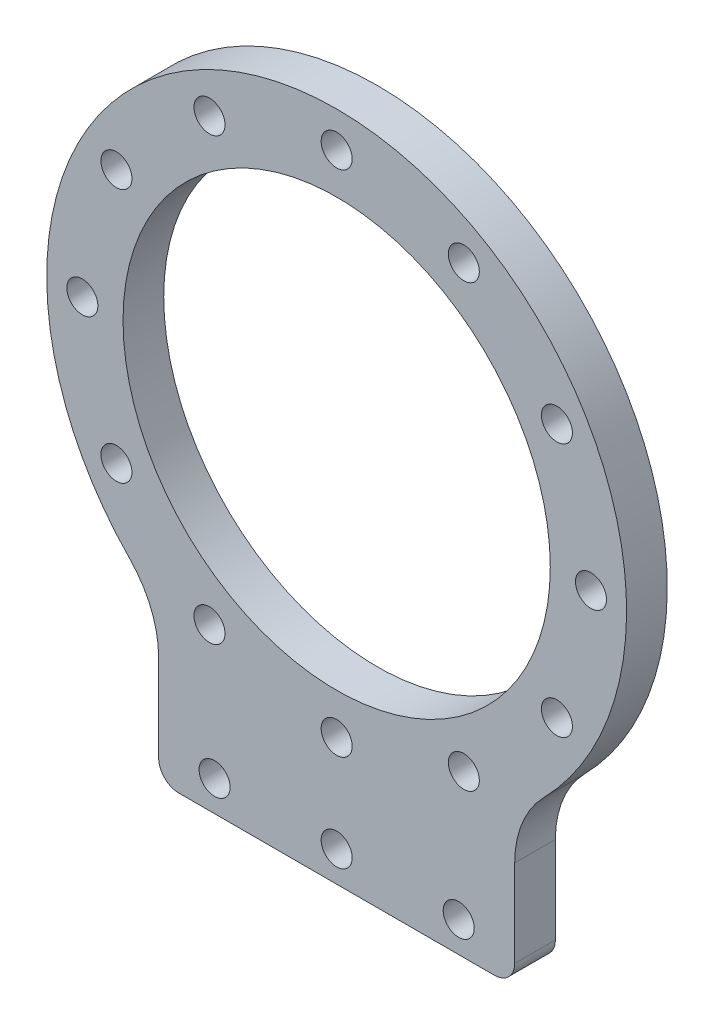
ISO-10303-21;
HEADER;
FILE_DESCRIPTION(('STEP AP214'),'2;1');
FILE_NAME('part.step','',(''),(''),'','','');
FILE_SCHEMA(('AUTOMOTIVE_DESIGN { 1 0 10303 214 1 1 1 1 }'));
ENDSEC;
DATA;
#1=APPLICATION_CONTEXT('core data for automotive mechanical design processes');
#2=APPLICATION_PROTOCOL_DEFINITION('international standard','automotive_design',2000,#1);
#3=PRODUCT_CONTEXT('',#1,'mechanical');
#4=PRODUCT('Part','Part','',(#3));
#5=PRODUCT_RELATED_PRODUCT_CATEGORY('part','',(#4));
#6=PRODUCT_DEFINITION_FORMATION('','',#4);
#7=PRODUCT_DEFINITION_CONTEXT('part definition',#1,'design');
#8=PRODUCT_DEFINITION('design','',#6,#7);
#9=PRODUCT_DEFINITION_SHAPE('','',#8);
#10=(LENGTH_UNIT() NAMED_UNIT(*) SI_UNIT(.MILLI.,.METRE.));
#11=(NAMED_UNIT(*) PLANE_ANGLE_UNIT() SI_UNIT($,.RADIAN.));
#12=(NAMED_UNIT(*) SI_UNIT($,.STERADIAN.) SOLID_ANGLE_UNIT());
#13=UNCERTAINTY_MEASURE_WITH_UNIT(LENGTH_MEASURE(1.E-05),#10,'distance_accuracy_value','');
#14=(GEOMETRIC_REPRESENTATION_CONTEXT(3) GLOBAL_UNCERTAINTY_ASSIGNED_CONTEXT((#13)) GLOBAL_UNIT_ASSIGNED_CONTEXT((#10,
#11,#12)) REPRESENTATION_CONTEXT('',''));
#15=CARTESIAN_POINT('',(0.,0.,0.));
#16=DIRECTION('',(0.,0.,1.));
#17=DIRECTION('',(1.,0.,0.));
#18=AXIS2_PLACEMENT_3D('',#15,#16,#17);
#19=CARTESIAN_POINT('',(0.,0.,4.));
#20=DIRECTION('',(0.,0.,-1.));
#21=DIRECTION('',(-1.,0.,0.));
#22=AXIS2_PLACEMENT_3D('',#19,#20,#21);
#23=CYLINDRICAL_SURFACE('',#22,28.5);
#24=CARTESIAN_POINT('',(0.,0.,4.));
#25=DIRECTION('',(0.,0.,1.));
#26=DIRECTION('',(1.,0.,0.));
#27=AXIS2_PLACEMENT_3D('',#24,#25,#26);
#28=CIRCLE('',#27,28.5);
#29=CARTESIAN_POINT('',(20.3571428571429,-19.9458450483773,4.));
#30=VERTEX_POINT('',#29);
#31=CARTESIAN_POINT('',(-20.3571428571429,-19.9458450483773,4.));
#32=VERTEX_POINT('',#31);
#33=EDGE_CURVE('E204',#30,#32,#28,.T.);
#34=ORIENTED_EDGE('',*,*,#33,.F.);
#35=DIRECTION('',(0.,0.,-1.));
#36=VECTOR('',#35,1.);
#37=CARTESIAN_POINT('',(20.3571428571429,-19.9458450483773,4.));
#38=LINE('',#37,#36);
#39=CARTESIAN_POINT('',(20.3571428571429,-19.9458450483773,0.));
#40=VERTEX_POINT('',#39);
#41=EDGE_CURVE('E172',#30,#40,#38,.T.);
#42=ORIENTED_EDGE('',*,*,#41,.T.);
#43=CARTESIAN_POINT('',(0.,0.,0.));
#44=DIRECTION('',(0.,0.,1.));
#45=DIRECTION('',(1.,0.,0.));
#46=AXIS2_PLACEMENT_3D('',#43,#44,#45);
#47=CIRCLE('',#46,28.5);
#48=CARTESIAN_POINT('',(-20.3571428571429,-19.9458450483773,0.));
#49=VERTEX_POINT('',#48);
#50=EDGE_CURVE('E189',#40,#49,#47,.T.);
#51=ORIENTED_EDGE('',*,*,#50,.T.);
#52=DIRECTION('',(0.,0.,-1.));
#53=VECTOR('',#52,1.);
#54=CARTESIAN_POINT('',(-20.3571428571429,-19.9458450483773,4.));
#55=LINE('',#54,#53);
#56=EDGE_CURVE('E169',#49,#32,#55,.F.);
#57=ORIENTED_EDGE('',*,*,#56,.T.);
#58=EDGE_LOOP('',(#34,#42,#51,#57));
#59=FACE_BOUND('',#58,.T.);
#60=ADVANCED_FACE('F45',(#59),#23,.T.);
#61=CARTESIAN_POINT('',(-17.5,0.,4.));
#62=DIRECTION('',(1.,0.,0.));
#63=DIRECTION('',(0.,1.,0.));
#64=AXIS2_PLACEMENT_3D('',#61,#62,#63);
#65=PLANE('',#64);
#66=DIRECTION('',(0.,-1.,0.));
#67=VECTOR('',#66,1.);
#68=CARTESIAN_POINT('',(-17.5,0.,4.));
#69=LINE('',#68,#67);
#70=CARTESIAN_POINT('',(-17.5,-26.944387170615,4.));
#71=VERTEX_POINT('',#70);
#72=CARTESIAN_POINT('',(-17.5,-35.5,4.));
#73=VERTEX_POINT('',#72);
#74=EDGE_CURVE('E199',#71,#73,#69,.T.);
#75=ORIENTED_EDGE('',*,*,#74,.F.);
#76=DIRECTION('',(0.,0.,1.));
#77=VECTOR('',#76,1.);
#78=CARTESIAN_POINT('',(-17.5,-26.944387170615,0.));
#79=LINE('',#78,#77);
#80=CARTESIAN_POINT('',(-17.5,-26.944387170615,0.));
#81=VERTEX_POINT('',#80);
#82=EDGE_CURVE('E179',#71,#81,#79,.F.);
#83=ORIENTED_EDGE('',*,*,#82,.T.);
#84=DIRECTION('',(0.,-1.,0.));
#85=VECTOR('',#84,1.);
#86=CARTESIAN_POINT('',(-17.5,0.,0.));
#87=LINE('',#86,#85);
#88=CARTESIAN_POINT('',(-17.5,-35.5,0.));
#89=VERTEX_POINT('',#88);
#90=EDGE_CURVE('E190',#81,#89,#87,.T.);
#91=ORIENTED_EDGE('',*,*,#90,.T.);
#92=DIRECTION('',(0.,0.,-1.));
#93=VECTOR('',#92,1.);
#94=CARTESIAN_POINT('',(-17.5,-35.5,4.));
#95=LINE('',#94,#93);
#96=EDGE_CURVE('E165',#89,#73,#95,.F.);
#97=ORIENTED_EDGE('',*,*,#96,.T.);
#98=EDGE_LOOP('',(#75,#83,#91,#97));
#99=FACE_BOUND('',#98,.T.);
#100=ADVANCED_FACE('F198',(#99),#65,.F.);
#101=CARTESIAN_POINT('',(0.,-37.5,4.));
#102=DIRECTION('',(0.,1.,0.));
#103=DIRECTION('',(0.,0.,1.));
#104=AXIS2_PLACEMENT_3D('',#101,#102,#103);
#105=PLANE('',#104);
#106=DIRECTION('',(1.,0.,0.));
#107=VECTOR('',#106,1.);
#108=CARTESIAN_POINT('',(0.,-37.5,0.));
#109=LINE('',#108,#107);
#110=CARTESIAN_POINT('',(-15.5,-37.5,0.));
#111=VERTEX_POINT('',#110);
#112=CARTESIAN_POINT('',(15.5,-37.5,0.));
#113=VERTEX_POINT('',#112);
#114=EDGE_CURVE('E123',#111,#113,#109,.T.);
#115=ORIENTED_EDGE('',*,*,#114,.T.);
#116=DIRECTION('',(0.,0.,-1.));
#117=VECTOR('',#116,1.);
#118=CARTESIAN_POINT('',(15.5,-37.5,4.));
#119=LINE('',#118,#117);
#120=CARTESIAN_POINT('',(15.5,-37.5,4.));
#121=VERTEX_POINT('',#120);
#122=EDGE_CURVE('E131',#113,#121,#119,.F.);
#123=ORIENTED_EDGE('',*,*,#122,.T.);
#124=DIRECTION('',(1.,0.,0.));
#125=VECTOR('',#124,1.);
#126=CARTESIAN_POINT('',(0.,-37.5,4.));
#127=LINE('',#126,#125);
#128=CARTESIAN_POINT('',(-15.5,-37.5,4.));
#129=VERTEX_POINT('',#128);
#130=EDGE_CURVE('E203',#129,#121,#127,.T.);
#131=ORIENTED_EDGE('',*,*,#130,.F.);
#132=DIRECTION('',(0.,0.,-1.));
#133=VECTOR('',#132,1.);
#134=CARTESIAN_POINT('',(-15.5,-37.5,4.));
#135=LINE('',#134,#133);
#136=EDGE_CURVE('E133',#129,#111,#135,.T.);
#137=ORIENTED_EDGE('',*,*,#136,.T.);
#138=EDGE_LOOP('',(#115,#123,#131,#137));
#139=FACE_BOUND('',#138,.T.);
#140=ADVANCED_FACE('F394',(#139),#105,.F.);
#141=CARTESIAN_POINT('',(25.,0.,4.));
#142=DIRECTION('',(0.,0.,-1.));
#143=DIRECTION('',(-1.,0.,0.));
#144=AXIS2_PLACEMENT_3D('',#141,#142,#143);
#145=CYLINDRICAL_SURFACE('',#144,1.525);
#146=CARTESIAN_POINT('',(25.,0.,4.));
#147=DIRECTION('',(0.,0.,1.));
#148=DIRECTION('',(1.,0.,0.));
#149=AXIS2_PLACEMENT_3D('',#146,#147,#148);
#150=CIRCLE('',#149,1.525);
#151=CARTESIAN_POINT('',(26.525,0.,4.));
#152=VERTEX_POINT('',#151);
#153=EDGE_CURVE('E148',#152,#152,#150,.T.);
#154=ORIENTED_EDGE('',*,*,#153,.T.);
#155=EDGE_LOOP('',(#154));
#156=FACE_BOUND('',#155,.T.);
#157=CARTESIAN_POINT('',(25.,0.,0.));
#158=DIRECTION('',(0.,0.,1.));
#159=DIRECTION('',(1.,0.,0.));
#160=AXIS2_PLACEMENT_3D('',#157,#158,#159);
#161=CIRCLE('',#160,1.525);
#162=CARTESIAN_POINT('',(26.525,0.,0.));
#163=VERTEX_POINT('',#162);
#164=EDGE_CURVE('E297',#163,#163,#161,.T.);
#165=ORIENTED_EDGE('',*,*,#164,.F.);
#166=EDGE_LOOP('',(#165));
#167=FACE_BOUND('',#166,.T.);
#168=ADVANCED_FACE('F489',(#156,#167),#145,.F.);
#169=CARTESIAN_POINT('',(21.6506350946108,-12.5000000000003,4.));
#170=DIRECTION('',(0.,0.,-1.));
#171=DIRECTION('',(-1.,0.,0.));
#172=AXIS2_PLACEMENT_3D('',#169,#170,#171);
#173=CYLINDRICAL_SURFACE('',#172,1.525);
#174=CARTESIAN_POINT('',(21.6506350946108,-12.5000000000003,4.));
#175=DIRECTION('',(0.,0.,1.));
#176=DIRECTION('',(1.,0.,0.));
#177=AXIS2_PLACEMENT_3D('',#174,#175,#176);
#178=CIRCLE('',#177,1.525);
#179=CARTESIAN_POINT('',(23.1756350946108,-12.5000000000003,4.));
#180=VERTEX_POINT('',#179);
#181=EDGE_CURVE('E248',#180,#180,#178,.T.);
#182=ORIENTED_EDGE('',*,*,#181,.T.);
#183=EDGE_LOOP('',(#182));
#184=FACE_BOUND('',#183,.T.);
#185=CARTESIAN_POINT('',(21.6506350946108,-12.5000000000003,0.));
#186=DIRECTION('',(0.,0.,1.));
#187=DIRECTION('',(1.,0.,0.));
#188=AXIS2_PLACEMENT_3D('',#185,#186,#187);
#189=CIRCLE('',#188,1.525);
#190=CARTESIAN_POINT('',(23.1756350946108,-12.5000000000003,0.));
#191=VERTEX_POINT('',#190);
#192=EDGE_CURVE('E294',#191,#191,#189,.T.);
#193=ORIENTED_EDGE('',*,*,#192,.F.);
#194=EDGE_LOOP('',(#193));
#195=FACE_BOUND('',#194,.T.);
#196=ADVANCED_FACE('F625',(#184,#195),#173,.F.);
#197=CARTESIAN_POINT('',(-12.5000000000004,-21.6506350946107,4.));
#198=DIRECTION('',(0.,0.,-1.));
#199=DIRECTION('',(-1.,0.,0.));
#200=AXIS2_PLACEMENT_3D('',#197,#198,#199);
#201=CYLINDRICAL_SURFACE('',#200,1.52499999999995);
#202=CARTESIAN_POINT('',(-12.5000000000004,-21.6506350946107,4.));
#203=DIRECTION('',(0.,0.,1.));
#204=DIRECTION('',(1.,0.,0.));
#205=AXIS2_PLACEMENT_3D('',#202,#203,#204);
#206=CIRCLE('',#205,1.52499999999995);
#207=CARTESIAN_POINT('',(-10.9750000000004,-21.6506350946107,4.));
#208=VERTEX_POINT('',#207);
#209=EDGE_CURVE('E244',#208,#208,#206,.T.);
#210=ORIENTED_EDGE('',*,*,#209,.T.);
#211=EDGE_LOOP('',(#210));
#212=FACE_BOUND('',#211,.T.);
#213=CARTESIAN_POINT('',(-12.5000000000004,-21.6506350946107,0.));
#214=DIRECTION('',(0.,0.,1.));
#215=DIRECTION('',(1.,0.,0.));
#216=AXIS2_PLACEMENT_3D('',#213,#214,#215);
#217=CIRCLE('',#216,1.52499999999995);
#218=CARTESIAN_POINT('',(-10.9750000000004,-21.6506350946107,0.));
#219=VERTEX_POINT('',#218);
#220=EDGE_CURVE('E290',#219,#219,#217,.T.);
#221=ORIENTED_EDGE('',*,*,#220,.F.);
#222=EDGE_LOOP('',(#221));
#223=FACE_BOUND('',#222,.T.);
#224=ADVANCED_FACE('F614',(#212,#223),#201,.F.);
#225=CARTESIAN_POINT('',(-21.650635094611,-12.4999999999999,4.));
#226=DIRECTION('',(0.,0.,-1.));
#227=DIRECTION('',(-1.,0.,0.));
#228=AXIS2_PLACEMENT_3D('',#225,#226,#227);
#229=CYLINDRICAL_SURFACE('',#228,1.525);
#230=CARTESIAN_POINT('',(-21.650635094611,-12.4999999999999,4.));
#231=DIRECTION('',(0.,0.,1.));
#232=DIRECTION('',(1.,0.,0.));
#233=AXIS2_PLACEMENT_3D('',#230,#231,#232);
#234=CIRCLE('',#233,1.525);
#235=CARTESIAN_POINT('',(-20.125635094611,-12.4999999999999,4.));
#236=VERTEX_POINT('',#235);
#237=EDGE_CURVE('E240',#236,#236,#234,.T.);
#238=ORIENTED_EDGE('',*,*,#237,.T.);
#239=EDGE_LOOP('',(#238));
#240=FACE_BOUND('',#239,.T.);
#241=CARTESIAN_POINT('',(-21.650635094611,-12.4999999999999,0.));
#242=DIRECTION('',(0.,0.,1.));
#243=DIRECTION('',(1.,0.,0.));
#244=AXIS2_PLACEMENT_3D('',#241,#242,#243);
#245=CIRCLE('',#244,1.525);
#246=CARTESIAN_POINT('',(-20.125635094611,-12.4999999999999,0.));
#247=VERTEX_POINT('',#246);
#248=EDGE_CURVE('E286',#247,#247,#245,.T.);
#249=ORIENTED_EDGE('',*,*,#248,.F.);
#250=EDGE_LOOP('',(#249));
#251=FACE_BOUND('',#250,.T.);
#252=ADVANCED_FACE('F603',(#240,#251),#229,.F.);
#253=CARTESIAN_POINT('',(-25.,1.79839122628977E-13,4.));
#254=DIRECTION('',(0.,0.,-1.));
#255=DIRECTION('',(-1.,0.,0.));
#256=AXIS2_PLACEMENT_3D('',#253,#254,#255);
#257=CYLINDRICAL_SURFACE('',#256,1.525);
#258=CARTESIAN_POINT('',(-25.,1.79839122628977E-13,4.));
#259=DIRECTION('',(0.,0.,1.));
#260=DIRECTION('',(1.,0.,0.));
#261=AXIS2_PLACEMENT_3D('',#258,#259,#260);
#262=CIRCLE('',#261,1.525);
#263=CARTESIAN_POINT('',(-23.475,1.79839122628977E-13,4.));
#264=VERTEX_POINT('',#263);
#265=EDGE_CURVE('E236',#264,#264,#262,.T.);
#266=ORIENTED_EDGE('',*,*,#265,.T.);
#267=EDGE_LOOP('',(#266));
#268=FACE_BOUND('',#267,.T.);
#269=CARTESIAN_POINT('',(-25.,1.79839122628977E-13,0.));
#270=DIRECTION('',(0.,0.,1.));
#271=DIRECTION('',(1.,0.,0.));
#272=AXIS2_PLACEMENT_3D('',#269,#270,#271);
#273=CIRCLE('',#272,1.525);
#274=CARTESIAN_POINT('',(-23.475,1.79839122628977E-13,0.));
#275=VERTEX_POINT('',#274);
#276=EDGE_CURVE('E282',#275,#275,#273,.T.);
#277=ORIENTED_EDGE('',*,*,#276,.F.);
#278=EDGE_LOOP('',(#277));
#279=FACE_BOUND('',#278,.T.);
#280=ADVANCED_FACE('F592',(#268,#279),#257,.F.);
#281=CARTESIAN_POINT('',(-21.6506350946109,12.5000000000002,4.));
#282=DIRECTION('',(0.,0.,-1.));
#283=DIRECTION('',(-1.,0.,0.));
#284=AXIS2_PLACEMENT_3D('',#281,#282,#283);
#285=CYLINDRICAL_SURFACE('',#284,1.525);
#286=CARTESIAN_POINT('',(-21.6506350946109,12.5000000000002,4.));
#287=DIRECTION('',(0.,0.,1.));
#288=DIRECTION('',(1.,0.,0.));
#289=AXIS2_PLACEMENT_3D('',#286,#287,#288);
#290=CIRCLE('',#289,1.525);
#291=CARTESIAN_POINT('',(-20.1256350946109,12.5000000000002,4.));
#292=VERTEX_POINT('',#291);
#293=EDGE_CURVE('E232',#292,#292,#290,.T.);
#294=ORIENTED_EDGE('',*,*,#293,.T.);
#295=EDGE_LOOP('',(#294));
#296=FACE_BOUND('',#295,.T.);
#297=CARTESIAN_POINT('',(-21.6506350946109,12.5000000000002,0.));
#298=DIRECTION('',(0.,0.,1.));
#299=DIRECTION('',(1.,0.,0.));
#300=AXIS2_PLACEMENT_3D('',#297,#298,#299);
#301=CIRCLE('',#300,1.525);
#302=CARTESIAN_POINT('',(-20.1256350946109,12.5000000000002,0.));
#303=VERTEX_POINT('',#302);
#304=EDGE_CURVE('E278',#303,#303,#301,.T.);
#305=ORIENTED_EDGE('',*,*,#304,.F.);
#306=EDGE_LOOP('',(#305));
#307=FACE_BOUND('',#306,.T.);
#308=ADVANCED_FACE('F581',(#296,#307),#285,.F.);
#309=CARTESIAN_POINT('',(-12.4999999999998,21.6506350946111,4.));
#310=DIRECTION('',(0.,0.,-1.));
#311=DIRECTION('',(-1.,0.,0.));
#312=AXIS2_PLACEMENT_3D('',#309,#310,#311);
#313=CYLINDRICAL_SURFACE('',#312,1.52499999999999);
#314=CARTESIAN_POINT('',(-12.4999999999998,21.6506350946111,4.));
#315=DIRECTION('',(0.,0.,1.));
#316=DIRECTION('',(1.,0.,0.));
#317=AXIS2_PLACEMENT_3D('',#314,#315,#316);
#318=CIRCLE('',#317,1.52499999999999);
#319=CARTESIAN_POINT('',(-10.9749999999998,21.6506350946111,4.));
#320=VERTEX_POINT('',#319);
#321=EDGE_CURVE('E228',#320,#320,#318,.T.);
#322=ORIENTED_EDGE('',*,*,#321,.T.);
#323=EDGE_LOOP('',(#322));
#324=FACE_BOUND('',#323,.T.);
#325=CARTESIAN_POINT('',(-12.4999999999998,21.6506350946111,0.));
#326=DIRECTION('',(0.,0.,1.));
#327=DIRECTION('',(1.,0.,0.));
#328=AXIS2_PLACEMENT_3D('',#325,#326,#327);
#329=CIRCLE('',#328,1.52499999999999);
#330=CARTESIAN_POINT('',(-10.9749999999998,21.6506350946111,0.));
#331=VERTEX_POINT('',#330);
#332=EDGE_CURVE('E274',#331,#331,#329,.T.);
#333=ORIENTED_EDGE('',*,*,#332,.F.);
#334=EDGE_LOOP('',(#333));
#335=FACE_BOUND('',#334,.T.);
#336=ADVANCED_FACE('F570',(#324,#335),#313,.F.);
#337=CARTESIAN_POINT('',(2.63677968348475E-13,25.,4.));
#338=DIRECTION('',(0.,0.,-1.));
#339=DIRECTION('',(-1.,0.,0.));
#340=AXIS2_PLACEMENT_3D('',#337,#338,#339);
#341=CYLINDRICAL_SURFACE('',#340,1.52499999999999);
#342=CARTESIAN_POINT('',(2.63677968348475E-13,25.,4.));
#343=DIRECTION('',(0.,0.,1.));
#344=DIRECTION('',(1.,0.,0.));
#345=AXIS2_PLACEMENT_3D('',#342,#343,#344);
#346=CIRCLE('',#345,1.52499999999999);
#347=CARTESIAN_POINT('',(1.52500000000026,25.,4.));
#348=VERTEX_POINT('',#347);
#349=EDGE_CURVE('E224',#348,#348,#346,.T.);
#350=ORIENTED_EDGE('',*,*,#349,.T.);
#351=EDGE_LOOP('',(#350));
#352=FACE_BOUND('',#351,.T.);
#353=CARTESIAN_POINT('',(2.63677968348475E-13,25.,0.));
#354=DIRECTION('',(0.,0.,1.));
#355=DIRECTION('',(1.,0.,0.));
#356=AXIS2_PLACEMENT_3D('',#353,#354,#355);
#357=CIRCLE('',#356,1.52499999999999);
#358=CARTESIAN_POINT('',(1.52500000000026,25.,0.));
#359=VERTEX_POINT('',#358);
#360=EDGE_CURVE('E270',#359,#359,#357,.T.);
#361=ORIENTED_EDGE('',*,*,#360,.F.);
#362=EDGE_LOOP('',(#361));
#363=FACE_BOUND('',#362,.T.);
#364=ADVANCED_FACE('F559',(#352,#363),#341,.F.);
#365=CARTESIAN_POINT('',(12.5000000000003,21.6506350946108,4.));
#366=DIRECTION('',(0.,0.,-1.));
#367=DIRECTION('',(-1.,0.,0.));
#368=AXIS2_PLACEMENT_3D('',#365,#366,#367);
#369=CYLINDRICAL_SURFACE('',#368,1.525);
#370=CARTESIAN_POINT('',(12.5000000000003,21.6506350946108,4.));
#371=DIRECTION('',(0.,0.,1.));
#372=DIRECTION('',(1.,0.,0.));
#373=AXIS2_PLACEMENT_3D('',#370,#371,#372);
#374=CIRCLE('',#373,1.525);
#375=CARTESIAN_POINT('',(14.0250000000003,21.6506350946108,4.));
#376=VERTEX_POINT('',#375);
#377=EDGE_CURVE('E220',#376,#376,#374,.T.);
#378=ORIENTED_EDGE('',*,*,#377,.T.);
#379=EDGE_LOOP('',(#378));
#380=FACE_BOUND('',#379,.T.);
#381=CARTESIAN_POINT('',(12.5000000000003,21.6506350946108,0.));
#382=DIRECTION('',(0.,0.,1.));
#383=DIRECTION('',(1.,0.,0.));
#384=AXIS2_PLACEMENT_3D('',#381,#382,#383);
#385=CIRCLE('',#384,1.525);
#386=CARTESIAN_POINT('',(14.0250000000003,21.6506350946108,0.));
#387=VERTEX_POINT('',#386);
#388=EDGE_CURVE('E266',#387,#387,#385,.T.);
#389=ORIENTED_EDGE('',*,*,#388,.F.);
#390=EDGE_LOOP('',(#389));
#391=FACE_BOUND('',#390,.T.);
#392=ADVANCED_FACE('F548',(#380,#391),#369,.F.);
#393=CARTESIAN_POINT('',(21.6506350946111,12.4999999999997,4.));
#394=DIRECTION('',(0.,0.,-1.));
#395=DIRECTION('',(-1.,0.,0.));
#396=AXIS2_PLACEMENT_3D('',#393,#394,#395);
#397=CYLINDRICAL_SURFACE('',#396,1.525);
#398=CARTESIAN_POINT('',(21.6506350946111,12.4999999999997,4.));
#399=DIRECTION('',(0.,0.,1.));
#400=DIRECTION('',(1.,0.,0.));
#401=AXIS2_PLACEMENT_3D('',#398,#399,#400);
#402=CIRCLE('',#401,1.525);
#403=CARTESIAN_POINT('',(23.1756350946111,12.4999999999997,4.));
#404=VERTEX_POINT('',#403);
#405=EDGE_CURVE('E216',#404,#404,#402,.T.);
#406=ORIENTED_EDGE('',*,*,#405,.T.);
#407=EDGE_LOOP('',(#406));
#408=FACE_BOUND('',#407,.T.);
#409=CARTESIAN_POINT('',(21.6506350946111,12.4999999999997,0.));
#410=DIRECTION('',(0.,0.,1.));
#411=DIRECTION('',(1.,0.,0.));
#412=AXIS2_PLACEMENT_3D('',#409,#410,#411);
#413=CIRCLE('',#412,1.525);
#414=CARTESIAN_POINT('',(23.1756350946111,12.4999999999997,0.));
#415=VERTEX_POINT('',#414);
#416=EDGE_CURVE('E122',#415,#415,#413,.T.);
#417=ORIENTED_EDGE('',*,*,#416,.F.);
#418=EDGE_LOOP('',(#417));
#419=FACE_BOUND('',#418,.T.);
#420=ADVANCED_FACE('F449',(#408,#419),#397,.F.);
#421=CARTESIAN_POINT('',(17.5,0.,4.));
#422=DIRECTION('',(1.,0.,0.));
#423=DIRECTION('',(0.,1.,0.));
#424=AXIS2_PLACEMENT_3D('',#421,#422,#423);
#425=PLANE('',#424);
#426=DIRECTION('',(0.,-1.,0.));
#427=VECTOR('',#426,1.);
#428=CARTESIAN_POINT('',(17.5,0.,0.));
#429=LINE('',#428,#427);
#430=CARTESIAN_POINT('',(17.5,-26.944387170615,0.));
#431=VERTEX_POINT('',#430);
#432=CARTESIAN_POINT('',(17.5,-35.5,0.));
#433=VERTEX_POINT('',#432);
#434=EDGE_CURVE('E109',#431,#433,#429,.T.);
#435=ORIENTED_EDGE('',*,*,#434,.F.);
#436=DIRECTION('',(0.,0.,-1.));
#437=VECTOR('',#436,1.);
#438=CARTESIAN_POINT('',(17.5,-26.944387170615,4.));
#439=LINE('',#438,#437);
#440=CARTESIAN_POINT('',(17.5,-26.944387170615,4.));
#441=VERTEX_POINT('',#440);
#442=EDGE_CURVE('E176',#431,#441,#439,.F.);
#443=ORIENTED_EDGE('',*,*,#442,.T.);
#444=DIRECTION('',(0.,-1.,0.));
#445=VECTOR('',#444,1.);
#446=CARTESIAN_POINT('',(17.5,0.,4.));
#447=LINE('',#446,#445);
#448=CARTESIAN_POINT('',(17.5,-35.5,4.));
#449=VERTEX_POINT('',#448);
#450=EDGE_CURVE('E138',#441,#449,#447,.T.);
#451=ORIENTED_EDGE('',*,*,#450,.T.);
#452=DIRECTION('',(0.,0.,-1.));
#453=VECTOR('',#452,1.);
#454=CARTESIAN_POINT('',(17.5,-35.5,0.));
#455=LINE('',#454,#453);
#456=EDGE_CURVE('E130',#449,#433,#455,.T.);
#457=ORIENTED_EDGE('',*,*,#456,.T.);
#458=EDGE_LOOP('',(#435,#443,#451,#457));
#459=FACE_BOUND('',#458,.T.);
#460=ADVANCED_FACE('F136',(#459),#425,.T.);
#461=CARTESIAN_POINT('',(12.4999999999996,-21.6506350946112,4.));
#462=DIRECTION('',(0.,0.,-1.));
#463=DIRECTION('',(-1.,0.,0.));
#464=AXIS2_PLACEMENT_3D('',#461,#462,#463);
#465=CYLINDRICAL_SURFACE('',#464,1.525);
#466=CARTESIAN_POINT('',(12.4999999999996,-21.6506350946112,4.));
#467=DIRECTION('',(0.,0.,1.));
#468=DIRECTION('',(1.,0.,0.));
#469=AXIS2_PLACEMENT_3D('',#466,#467,#468);
#470=CIRCLE('',#469,1.525);
#471=CARTESIAN_POINT('',(14.0249999999996,-21.6506350946112,4.));
#472=VERTEX_POINT('',#471);
#473=EDGE_CURVE('E210',#472,#472,#470,.T.);
#474=ORIENTED_EDGE('',*,*,#473,.T.);
#475=EDGE_LOOP('',(#474));
#476=FACE_BOUND('',#475,.T.);
#477=CARTESIAN_POINT('',(12.4999999999996,-21.6506350946112,0.));
#478=DIRECTION('',(0.,0.,1.));
#479=DIRECTION('',(1.,0.,0.));
#480=AXIS2_PLACEMENT_3D('',#477,#478,#479);
#481=CIRCLE('',#480,1.525);
#482=CARTESIAN_POINT('',(14.0249999999996,-21.6506350946112,0.));
#483=VERTEX_POINT('',#482);
#484=EDGE_CURVE('E195',#483,#483,#481,.T.);
#485=ORIENTED_EDGE('',*,*,#484,.F.);
#486=EDGE_LOOP('',(#485));
#487=FACE_BOUND('',#486,.T.);
#488=ADVANCED_FACE('F381',(#476,#487),#465,.F.);
#489=CARTESIAN_POINT('',(-4.38885039422132E-13,-25.,4.));
#490=DIRECTION('',(0.,0.,-1.));
#491=DIRECTION('',(-1.,0.,0.));
#492=AXIS2_PLACEMENT_3D('',#489,#490,#491);
#493=CYLINDRICAL_SURFACE('',#492,1.525);
#494=CARTESIAN_POINT('',(-4.38885039422132E-13,-25.,4.));
#495=DIRECTION('',(0.,0.,1.));
#496=DIRECTION('',(1.,0.,0.));
#497=AXIS2_PLACEMENT_3D('',#494,#495,#496);
#498=CIRCLE('',#497,1.525);
#499=CARTESIAN_POINT('',(1.52499999999956,-25.,4.));
#500=VERTEX_POINT('',#499);
#501=EDGE_CURVE('E141',#500,#500,#498,.T.);
#502=ORIENTED_EDGE('',*,*,#501,.T.);
#503=EDGE_LOOP('',(#502));
#504=FACE_BOUND('',#503,.T.);
#505=CARTESIAN_POINT('',(-4.38885039422132E-13,-25.,0.));
#506=DIRECTION('',(0.,0.,1.));
#507=DIRECTION('',(1.,0.,0.));
#508=AXIS2_PLACEMENT_3D('',#505,#506,#507);
#509=CIRCLE('',#508,1.525);
#510=CARTESIAN_POINT('',(1.52499999999956,-25.,0.));
#511=VERTEX_POINT('',#510);
#512=EDGE_CURVE('E151',#511,#511,#509,.T.);
#513=ORIENTED_EDGE('',*,*,#512,.F.);
#514=EDGE_LOOP('',(#513));
#515=FACE_BOUND('',#514,.T.);
#516=ADVANCED_FACE('F348',(#504,#515),#493,.F.);
#517=CARTESIAN_POINT('',(0.,0.,4.));
#518=DIRECTION('',(0.,0.,1.));
#519=DIRECTION('',(1.,0.,0.));
#520=AXIS2_PLACEMENT_3D('',#517,#518,#519);
#521=PLANE('',#520);
#522=CARTESIAN_POINT('',(-12.,-34.5,4.));
#523=DIRECTION('',(0.,0.,1.));
#524=DIRECTION('',(-1.,0.,0.));
#525=AXIS2_PLACEMENT_3D('',#522,#523,#524);
#526=CIRCLE('',#525,1.525);
#527=CARTESIAN_POINT('',(-13.525,-34.5,4.));
#528=VERTEX_POINT('',#527);
#529=EDGE_CURVE('E331',#528,#528,#526,.T.);
#530=ORIENTED_EDGE('',*,*,#529,.F.);
#531=EDGE_LOOP('',(#530));
#532=FACE_BOUND('',#531,.T.);
#533=CARTESIAN_POINT('',(12.,-34.5,4.));
#534=DIRECTION('',(0.,0.,1.));
#535=DIRECTION('',(1.,0.,0.));
#536=AXIS2_PLACEMENT_3D('',#533,#534,#535);
#537=CIRCLE('',#536,1.525);
#538=CARTESIAN_POINT('',(13.525,-34.5,4.));
#539=VERTEX_POINT('',#538);
#540=EDGE_CURVE('E323',#539,#539,#537,.T.);
#541=ORIENTED_EDGE('',*,*,#540,.F.);
#542=EDGE_LOOP('',(#541));
#543=FACE_BOUND('',#542,.T.);
#544=CARTESIAN_POINT('',(0.,-34.5,4.));
#545=DIRECTION('',(0.,0.,1.));
#546=DIRECTION('',(1.,0.,0.));
#547=AXIS2_PLACEMENT_3D('',#544,#545,#546);
#548=CIRCLE('',#547,1.525);
#549=CARTESIAN_POINT('',(1.525,-34.5,4.));
#550=VERTEX_POINT('',#549);
#551=EDGE_CURVE('E319',#550,#550,#548,.T.);
#552=ORIENTED_EDGE('',*,*,#551,.F.);
#553=EDGE_LOOP('',(#552));
#554=FACE_BOUND('',#553,.T.);
#555=CARTESIAN_POINT('',(0.,0.,4.));
#556=DIRECTION('',(0.,0.,1.));
#557=DIRECTION('',(1.,0.,0.));
#558=AXIS2_PLACEMENT_3D('',#555,#556,#557);
#559=CIRCLE('',#558,21.);
#560=CARTESIAN_POINT('',(21.,0.,4.));
#561=VERTEX_POINT('',#560);
#562=EDGE_CURVE('E311',#561,#561,#559,.T.);
#563=ORIENTED_EDGE('',*,*,#562,.F.);
#564=EDGE_LOOP('',(#563));
#565=FACE_BOUND('',#564,.T.);
#566=ORIENTED_EDGE('',*,*,#473,.F.);
#567=EDGE_LOOP('',(#566));
#568=FACE_BOUND('',#567,.T.);
#569=ORIENTED_EDGE('',*,*,#130,.T.);
#570=CARTESIAN_POINT('',(15.5,-35.5,4.));
#571=DIRECTION('',(0.,0.,1.));
#572=DIRECTION('',(1.,0.,0.));
#573=AXIS2_PLACEMENT_3D('',#570,#571,#572);
#574=CIRCLE('',#573,2.);
#575=EDGE_CURVE('E162',#121,#449,#574,.T.);
#576=ORIENTED_EDGE('',*,*,#575,.T.);
#577=ORIENTED_EDGE('',*,*,#450,.F.);
#578=CARTESIAN_POINT('',(27.5,-26.944387170615,4.));
#579=DIRECTION('',(0.,0.,1.));
#580=DIRECTION('',(1.,0.,0.));
#581=AXIS2_PLACEMENT_3D('',#578,#579,#580);
#582=CIRCLE('',#581,10.);
#583=EDGE_CURVE('E184',#441,#30,#582,.F.);
#584=ORIENTED_EDGE('',*,*,#583,.T.);
#585=ORIENTED_EDGE('',*,*,#33,.T.);
#586=CARTESIAN_POINT('',(-27.5,-26.944387170615,4.));
#587=DIRECTION('',(0.,0.,1.));
#588=DIRECTION('',(1.,0.,0.));
#589=AXIS2_PLACEMENT_3D('',#586,#587,#588);
#590=CIRCLE('',#589,10.);
#591=EDGE_CURVE('E11',#32,#71,#590,.F.);
#592=ORIENTED_EDGE('',*,*,#591,.T.);
#593=ORIENTED_EDGE('',*,*,#74,.T.);
#594=CARTESIAN_POINT('',(-15.5,-35.5,4.));
#595=DIRECTION('',(0.,0.,1.));
#596=DIRECTION('',(1.,0.,0.));
#597=AXIS2_PLACEMENT_3D('',#594,#595,#596);
#598=CIRCLE('',#597,2.);
#599=EDGE_CURVE('E159',#73,#129,#598,.T.);
#600=ORIENTED_EDGE('',*,*,#599,.T.);
#601=EDGE_LOOP('',(#569,#576,#577,#584,#585,#592,#593,#600));
#602=FACE_BOUND('',#601,.T.);
#603=ORIENTED_EDGE('',*,*,#405,.F.);
#604=EDGE_LOOP('',(#603));
#605=FACE_BOUND('',#604,.T.);
#606=ORIENTED_EDGE('',*,*,#377,.F.);
#607=EDGE_LOOP('',(#606));
#608=FACE_BOUND('',#607,.T.);
#609=ORIENTED_EDGE('',*,*,#349,.F.);
#610=EDGE_LOOP('',(#609));
#611=FACE_BOUND('',#610,.T.);
#612=ORIENTED_EDGE('',*,*,#321,.F.);
#613=EDGE_LOOP('',(#612));
#614=FACE_BOUND('',#613,.T.);
#615=ORIENTED_EDGE('',*,*,#293,.F.);
#616=EDGE_LOOP('',(#615));
#617=FACE_BOUND('',#616,.T.);
#618=ORIENTED_EDGE('',*,*,#265,.F.);
#619=EDGE_LOOP('',(#618));
#620=FACE_BOUND('',#619,.T.);
#621=ORIENTED_EDGE('',*,*,#237,.F.);
#622=EDGE_LOOP('',(#621));
#623=FACE_BOUND('',#622,.T.);
#624=ORIENTED_EDGE('',*,*,#209,.F.);
#625=EDGE_LOOP('',(#624));
#626=FACE_BOUND('',#625,.T.);
#627=ORIENTED_EDGE('',*,*,#181,.F.);
#628=EDGE_LOOP('',(#627));
#629=FACE_BOUND('',#628,.T.);
#630=ORIENTED_EDGE('',*,*,#153,.F.);
#631=EDGE_LOOP('',(#630));
#632=FACE_BOUND('',#631,.T.);
#633=ORIENTED_EDGE('',*,*,#501,.F.);
#634=EDGE_LOOP('',(#633));
#635=FACE_BOUND('',#634,.T.);
#636=ADVANCED_FACE('F345',(#532,#543,#554,#565,#568,#602,#605,#608,#611,#614,#617,#620,#623,
#626,#629,#632,#635),#521,.T.);
#637=CARTESIAN_POINT('',(0.,0.,0.));
#638=DIRECTION('',(0.,0.,1.));
#639=DIRECTION('',(1.,0.,0.));
#640=AXIS2_PLACEMENT_3D('',#637,#638,#639);
#641=PLANE('',#640);
#642=CARTESIAN_POINT('',(-12.,-34.5,0.));
#643=DIRECTION('',(0.,0.,1.));
#644=DIRECTION('',(-1.,0.,0.));
#645=AXIS2_PLACEMENT_3D('',#642,#643,#644);
#646=CIRCLE('',#645,1.525);
#647=CARTESIAN_POINT('',(-13.525,-34.5,0.));
#648=VERTEX_POINT('',#647);
#649=EDGE_CURVE('E327',#648,#648,#646,.T.);
#650=ORIENTED_EDGE('',*,*,#649,.T.);
#651=EDGE_LOOP('',(#650));
#652=FACE_BOUND('',#651,.T.);
#653=CARTESIAN_POINT('',(12.,-34.5,0.));
#654=DIRECTION('',(0.,0.,1.));
#655=DIRECTION('',(1.,0.,0.));
#656=AXIS2_PLACEMENT_3D('',#653,#654,#655);
#657=CIRCLE('',#656,1.525);
#658=CARTESIAN_POINT('',(13.525,-34.5,0.));
#659=VERTEX_POINT('',#658);
#660=EDGE_CURVE('E335',#659,#659,#657,.T.);
#661=ORIENTED_EDGE('',*,*,#660,.T.);
#662=EDGE_LOOP('',(#661));
#663=FACE_BOUND('',#662,.T.);
#664=CARTESIAN_POINT('',(0.,-34.5,0.));
#665=DIRECTION('',(0.,0.,1.));
#666=DIRECTION('',(1.,0.,0.));
#667=AXIS2_PLACEMENT_3D('',#664,#665,#666);
#668=CIRCLE('',#667,1.525);
#669=CARTESIAN_POINT('',(1.525,-34.5,0.));
#670=VERTEX_POINT('',#669);
#671=EDGE_CURVE('E315',#670,#670,#668,.T.);
#672=ORIENTED_EDGE('',*,*,#671,.T.);
#673=EDGE_LOOP('',(#672));
#674=FACE_BOUND('',#673,.T.);
#675=CARTESIAN_POINT('',(0.,0.,0.));
#676=DIRECTION('',(0.,0.,1.));
#677=DIRECTION('',(1.,0.,0.));
#678=AXIS2_PLACEMENT_3D('',#675,#676,#677);
#679=CIRCLE('',#678,21.);
#680=CARTESIAN_POINT('',(21.,0.,0.));
#681=VERTEX_POINT('',#680);
#682=EDGE_CURVE('E257',#681,#681,#679,.T.);
#683=ORIENTED_EDGE('',*,*,#682,.T.);
#684=EDGE_LOOP('',(#683));
#685=FACE_BOUND('',#684,.T.);
#686=ORIENTED_EDGE('',*,*,#484,.T.);
#687=EDGE_LOOP('',(#686));
#688=FACE_BOUND('',#687,.T.);
#689=ORIENTED_EDGE('',*,*,#50,.F.);
#690=CARTESIAN_POINT('',(27.5,-26.944387170615,0.));
#691=DIRECTION('',(0.,0.,1.));
#692=DIRECTION('',(1.,0.,0.));
#693=AXIS2_PLACEMENT_3D('',#690,#691,#692);
#694=CIRCLE('',#693,10.);
#695=EDGE_CURVE('E117',#40,#431,#694,.T.);
#696=ORIENTED_EDGE('',*,*,#695,.T.);
#697=ORIENTED_EDGE('',*,*,#434,.T.);
#698=CARTESIAN_POINT('',(15.5,-35.5,0.));
#699=DIRECTION('',(0.,0.,1.));
#700=DIRECTION('',(1.,0.,0.));
#701=AXIS2_PLACEMENT_3D('',#698,#699,#700);
#702=CIRCLE('',#701,2.);
#703=EDGE_CURVE('E115',#433,#113,#702,.F.);
#704=ORIENTED_EDGE('',*,*,#703,.T.);
#705=ORIENTED_EDGE('',*,*,#114,.F.);
#706=CARTESIAN_POINT('',(-15.5,-35.5,0.));
#707=DIRECTION('',(0.,0.,1.));
#708=DIRECTION('',(1.,0.,0.));
#709=AXIS2_PLACEMENT_3D('',#706,#707,#708);
#710=CIRCLE('',#709,2.);
#711=EDGE_CURVE('E134',#111,#89,#710,.F.);
#712=ORIENTED_EDGE('',*,*,#711,.T.);
#713=ORIENTED_EDGE('',*,*,#90,.F.);
#714=CARTESIAN_POINT('',(-27.5,-26.944387170615,0.));
#715=DIRECTION('',(0.,0.,1.));
#716=DIRECTION('',(1.,0.,0.));
#717=AXIS2_PLACEMENT_3D('',#714,#715,#716);
#718=CIRCLE('',#717,10.);
#719=EDGE_CURVE('E54',#81,#49,#718,.T.);
#720=ORIENTED_EDGE('',*,*,#719,.T.);
#721=EDGE_LOOP('',(#689,#696,#697,#704,#705,#712,#713,#720));
#722=FACE_BOUND('',#721,.T.);
#723=ORIENTED_EDGE('',*,*,#416,.T.);
#724=EDGE_LOOP('',(#723));
#725=FACE_BOUND('',#724,.T.);
#726=ORIENTED_EDGE('',*,*,#388,.T.);
#727=EDGE_LOOP('',(#726));
#728=FACE_BOUND('',#727,.T.);
#729=ORIENTED_EDGE('',*,*,#360,.T.);
#730=EDGE_LOOP('',(#729));
#731=FACE_BOUND('',#730,.T.);
#732=ORIENTED_EDGE('',*,*,#332,.T.);
#733=EDGE_LOOP('',(#732));
#734=FACE_BOUND('',#733,.T.);
#735=ORIENTED_EDGE('',*,*,#304,.T.);
#736=EDGE_LOOP('',(#735));
#737=FACE_BOUND('',#736,.T.);
#738=ORIENTED_EDGE('',*,*,#276,.T.);
#739=EDGE_LOOP('',(#738));
#740=FACE_BOUND('',#739,.T.);
#741=ORIENTED_EDGE('',*,*,#248,.T.);
#742=EDGE_LOOP('',(#741));
#743=FACE_BOUND('',#742,.T.);
#744=ORIENTED_EDGE('',*,*,#220,.T.);
#745=EDGE_LOOP('',(#744));
#746=FACE_BOUND('',#745,.T.);
#747=ORIENTED_EDGE('',*,*,#192,.T.);
#748=EDGE_LOOP('',(#747));
#749=FACE_BOUND('',#748,.T.);
#750=ORIENTED_EDGE('',*,*,#164,.T.);
#751=EDGE_LOOP('',(#750));
#752=FACE_BOUND('',#751,.T.);
#753=ORIENTED_EDGE('',*,*,#512,.T.);
#754=EDGE_LOOP('',(#753));
#755=FACE_BOUND('',#754,.T.);
#756=ADVANCED_FACE('F112',(#652,#663,#674,#685,#688,#722,#725,#728,#731,#734,#737,#740,#743,
#746,#749,#752,#755),#641,.F.);
#757=CARTESIAN_POINT('',(0.,0.,0.));
#758=DIRECTION('',(0.,0.,1.));
#759=DIRECTION('',(1.,0.,0.));
#760=AXIS2_PLACEMENT_3D('',#757,#758,#759);
#761=CYLINDRICAL_SURFACE('',#760,21.);
#762=ORIENTED_EDGE('',*,*,#682,.F.);
#763=EDGE_LOOP('',(#762));
#764=FACE_BOUND('',#763,.T.);
#765=ORIENTED_EDGE('',*,*,#562,.T.);
#766=EDGE_LOOP('',(#765));
#767=FACE_BOUND('',#766,.T.);
#768=ADVANCED_FACE('F429',(#764,#767),#761,.F.);
#769=CARTESIAN_POINT('',(0.,-34.5,0.));
#770=DIRECTION('',(0.,0.,1.));
#771=DIRECTION('',(1.,0.,0.));
#772=AXIS2_PLACEMENT_3D('',#769,#770,#771);
#773=CYLINDRICAL_SURFACE('',#772,1.525);
#774=ORIENTED_EDGE('',*,*,#671,.F.);
#775=EDGE_LOOP('',(#774));
#776=FACE_BOUND('',#775,.T.);
#777=ORIENTED_EDGE('',*,*,#551,.T.);
#778=EDGE_LOOP('',(#777));
#779=FACE_BOUND('',#778,.T.);
#780=ADVANCED_FACE('F509',(#776,#779),#773,.F.);
#781=CARTESIAN_POINT('',(12.,-34.5,0.));
#782=DIRECTION('',(0.,0.,1.));
#783=DIRECTION('',(1.,0.,0.));
#784=AXIS2_PLACEMENT_3D('',#781,#782,#783);
#785=CYLINDRICAL_SURFACE('',#784,1.525);
#786=ORIENTED_EDGE('',*,*,#660,.F.);
#787=EDGE_LOOP('',(#786));
#788=FACE_BOUND('',#787,.T.);
#789=ORIENTED_EDGE('',*,*,#540,.T.);
#790=EDGE_LOOP('',(#789));
#791=FACE_BOUND('',#790,.T.);
#792=ADVANCED_FACE('F343',(#788,#791),#785,.F.);
#793=CARTESIAN_POINT('',(-12.,-34.5,0.));
#794=DIRECTION('',(0.,0.,1.));
#795=DIRECTION('',(1.,0.,0.));
#796=AXIS2_PLACEMENT_3D('',#793,#794,#795);
#797=CYLINDRICAL_SURFACE('',#796,1.525);
#798=ORIENTED_EDGE('',*,*,#649,.F.);
#799=EDGE_LOOP('',(#798));
#800=FACE_BOUND('',#799,.T.);
#801=ORIENTED_EDGE('',*,*,#529,.T.);
#802=EDGE_LOOP('',(#801));
#803=FACE_BOUND('',#802,.T.);
#804=ADVANCED_FACE('F401',(#800,#803),#797,.F.);
#805=CARTESIAN_POINT('',(15.5,-35.5,4.));
#806=DIRECTION('',(0.,0.,1.));
#807=DIRECTION('',(1.,0.,0.));
#808=AXIS2_PLACEMENT_3D('',#805,#806,#807);
#809=CYLINDRICAL_SURFACE('',#808,2.);
#810=ORIENTED_EDGE('',*,*,#575,.F.);
#811=ORIENTED_EDGE('',*,*,#122,.F.);
#812=ORIENTED_EDGE('',*,*,#703,.F.);
#813=ORIENTED_EDGE('',*,*,#456,.F.);
#814=EDGE_LOOP('',(#810,#811,#812,#813));
#815=FACE_BOUND('',#814,.T.);
#816=ADVANCED_FACE('F129',(#815),#809,.T.);
#817=CARTESIAN_POINT('',(-15.5,-35.5,4.));
#818=DIRECTION('',(0.,0.,-1.));
#819=DIRECTION('',(-1.,0.,0.));
#820=AXIS2_PLACEMENT_3D('',#817,#818,#819);
#821=CYLINDRICAL_SURFACE('',#820,2.);
#822=ORIENTED_EDGE('',*,*,#599,.F.);
#823=ORIENTED_EDGE('',*,*,#96,.F.);
#824=ORIENTED_EDGE('',*,*,#711,.F.);
#825=ORIENTED_EDGE('',*,*,#136,.F.);
#826=EDGE_LOOP('',(#822,#823,#824,#825));
#827=FACE_BOUND('',#826,.T.);
#828=ADVANCED_FACE('F400',(#827),#821,.T.);
#829=CARTESIAN_POINT('',(27.5,-26.944387170615,4.));
#830=DIRECTION('',(0.,0.,-1.));
#831=DIRECTION('',(-1.,0.,0.));
#832=AXIS2_PLACEMENT_3D('',#829,#830,#831);
#833=CYLINDRICAL_SURFACE('',#832,10.);
#834=ORIENTED_EDGE('',*,*,#583,.F.);
#835=ORIENTED_EDGE('',*,*,#442,.F.);
#836=ORIENTED_EDGE('',*,*,#695,.F.);
#837=ORIENTED_EDGE('',*,*,#41,.F.);
#838=EDGE_LOOP('',(#834,#835,#836,#837));
#839=FACE_BOUND('',#838,.T.);
#840=ADVANCED_FACE('F403',(#839),#833,.F.);
#841=CARTESIAN_POINT('',(-27.5,-26.944387170615,4.));
#842=DIRECTION('',(0.,0.,-1.));
#843=DIRECTION('',(-1.,0.,0.));
#844=AXIS2_PLACEMENT_3D('',#841,#842,#843);
#845=CYLINDRICAL_SURFACE('',#844,10.);
#846=ORIENTED_EDGE('',*,*,#591,.F.);
#847=ORIENTED_EDGE('',*,*,#56,.F.);
#848=ORIENTED_EDGE('',*,*,#719,.F.);
#849=ORIENTED_EDGE('',*,*,#82,.F.);
#850=EDGE_LOOP('',(#846,#847,#848,#849));
#851=FACE_BOUND('',#850,.T.);
#852=ADVANCED_FACE('F47',(#851),#845,.F.);
#853=CLOSED_SHELL('',(#60,#100,#140,#168,#196,#224,#252,#280,#308,#336,#364,#392,#420,#460,#488,
#516,#636,#756,#768,#780,#792,#804,#816,#828,#840,#852));
#854=MANIFOLD_SOLID_BREP('B2',#853);
#855=ADVANCED_BREP_SHAPE_REPRESENTATION('',(#18,#854),#14);
#856=SHAPE_DEFINITION_REPRESENTATION(#9,#855);
ENDSEC;
END-ISO-10303-21;
